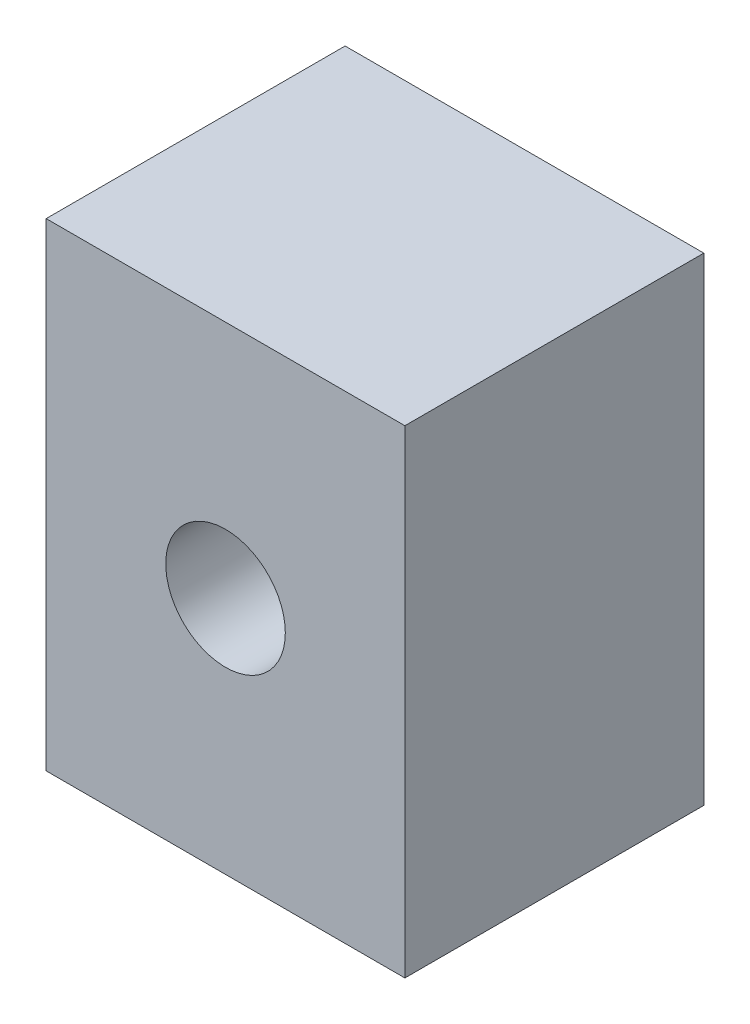
ISO-10303-21;
HEADER;
FILE_DESCRIPTION(('STEP AP214'),'2;1');
FILE_NAME('part.step','',(''),(''),'','','');
FILE_SCHEMA(('AUTOMOTIVE_DESIGN { 1 0 10303 214 1 1 1 1 }'));
ENDSEC;
DATA;
#1=APPLICATION_CONTEXT('core data for automotive mechanical design processes');
#2=APPLICATION_PROTOCOL_DEFINITION('international standard','automotive_design',2000,#1);
#3=PRODUCT_CONTEXT('',#1,'mechanical');
#4=PRODUCT('Part','Part','',(#3));
#5=PRODUCT_RELATED_PRODUCT_CATEGORY('part','',(#4));
#6=PRODUCT_DEFINITION_FORMATION('','',#4);
#7=PRODUCT_DEFINITION_CONTEXT('part definition',#1,'design');
#8=PRODUCT_DEFINITION('design','',#6,#7);
#9=PRODUCT_DEFINITION_SHAPE('','',#8);
#10=(LENGTH_UNIT() NAMED_UNIT(*) SI_UNIT(.MILLI.,.METRE.));
#11=(NAMED_UNIT(*) PLANE_ANGLE_UNIT() SI_UNIT($,.RADIAN.));
#12=(NAMED_UNIT(*) SI_UNIT($,.STERADIAN.) SOLID_ANGLE_UNIT());
#13=UNCERTAINTY_MEASURE_WITH_UNIT(LENGTH_MEASURE(1.E-05),#10,'distance_accuracy_value','');
#14=(GEOMETRIC_REPRESENTATION_CONTEXT(3) GLOBAL_UNCERTAINTY_ASSIGNED_CONTEXT((#13)) GLOBAL_UNIT_ASSIGNED_CONTEXT((#10,
#11,#12)) REPRESENTATION_CONTEXT('',''));
#15=CARTESIAN_POINT('',(0.,0.,0.));
#16=DIRECTION('',(0.,0.,1.));
#17=DIRECTION('',(1.,0.,0.));
#18=AXIS2_PLACEMENT_3D('',#15,#16,#17);
#19=CARTESIAN_POINT('',(15.,40.,12.5));
#20=DIRECTION('',(-1.,0.,0.));
#21=DIRECTION('',(0.,0.,1.));
#22=AXIS2_PLACEMENT_3D('',#19,#20,#21);
#23=PLANE('',#22);
#24=DIRECTION('',(0.,0.,-1.));
#25=VECTOR('',#24,1.);
#26=CARTESIAN_POINT('',(15.,0.,12.5));
#27=LINE('',#26,#25);
#28=CARTESIAN_POINT('',(15.,0.,12.5));
#29=VERTEX_POINT('',#28);
#30=CARTESIAN_POINT('',(15.,0.,-12.5));
#31=VERTEX_POINT('',#30);
#32=EDGE_CURVE('E107',#29,#31,#27,.T.);
#33=ORIENTED_EDGE('',*,*,#32,.T.);
#34=DIRECTION('',(0.,-1.,0.));
#35=VECTOR('',#34,1.);
#36=CARTESIAN_POINT('',(15.,40.,-12.5));
#37=LINE('',#36,#35);
#38=CARTESIAN_POINT('',(15.,40.,-12.5));
#39=VERTEX_POINT('',#38);
#40=EDGE_CURVE('E11',#39,#31,#37,.T.);
#41=ORIENTED_EDGE('',*,*,#40,.F.);
#42=DIRECTION('',(0.,0.,-1.));
#43=VECTOR('',#42,1.);
#44=CARTESIAN_POINT('',(15.,40.,12.5));
#45=LINE('',#44,#43);
#46=CARTESIAN_POINT('',(15.,40.,12.5));
#47=VERTEX_POINT('',#46);
#48=EDGE_CURVE('E91',#47,#39,#45,.T.);
#49=ORIENTED_EDGE('',*,*,#48,.F.);
#50=DIRECTION('',(0.,-1.,0.));
#51=VECTOR('',#50,1.);
#52=CARTESIAN_POINT('',(15.,40.,12.5));
#53=LINE('',#52,#51);
#54=EDGE_CURVE('E103',#47,#29,#53,.T.);
#55=ORIENTED_EDGE('',*,*,#54,.T.);
#56=EDGE_LOOP('',(#33,#41,#49,#55));
#57=FACE_BOUND('',#56,.T.);
#58=ADVANCED_FACE('F39',(#57),#23,.F.);
#59=CARTESIAN_POINT('',(-15.,40.,-12.5));
#60=DIRECTION('',(0.,0.,1.));
#61=DIRECTION('',(1.,0.,0.));
#62=AXIS2_PLACEMENT_3D('',#59,#60,#61);
#63=PLANE('',#62);
#64=CARTESIAN_POINT('',(0.,20.,-12.5));
#65=DIRECTION('',(0.,0.,1.));
#66=DIRECTION('',(1.,0.,0.));
#67=AXIS2_PLACEMENT_3D('',#64,#65,#66);
#68=CIRCLE('',#67,5.);
#69=CARTESIAN_POINT('',(5.00000000000001,20.,-12.5));
#70=VERTEX_POINT('',#69);
#71=EDGE_CURVE('E111',#70,#70,#68,.T.);
#72=ORIENTED_EDGE('',*,*,#71,.T.);
#73=EDGE_LOOP('',(#72));
#74=FACE_BOUND('',#73,.T.);
#75=DIRECTION('',(-1.,0.,0.));
#76=VECTOR('',#75,1.);
#77=CARTESIAN_POINT('',(-15.,0.,-12.5));
#78=LINE('',#77,#76);
#79=CARTESIAN_POINT('',(-15.,0.,-12.5));
#80=VERTEX_POINT('',#79);
#81=EDGE_CURVE('E96',#31,#80,#78,.T.);
#82=ORIENTED_EDGE('',*,*,#81,.T.);
#83=DIRECTION('',(0.,-1.,0.));
#84=VECTOR('',#83,1.);
#85=CARTESIAN_POINT('',(-15.,40.,-12.5));
#86=LINE('',#85,#84);
#87=CARTESIAN_POINT('',(-15.,40.,-12.5));
#88=VERTEX_POINT('',#87);
#89=EDGE_CURVE('E48',#88,#80,#86,.T.);
#90=ORIENTED_EDGE('',*,*,#89,.F.);
#91=DIRECTION('',(-1.,0.,0.));
#92=VECTOR('',#91,1.);
#93=CARTESIAN_POINT('',(-15.,40.,-12.5));
#94=LINE('',#93,#92);
#95=EDGE_CURVE('E86',#39,#88,#94,.T.);
#96=ORIENTED_EDGE('',*,*,#95,.F.);
#97=ORIENTED_EDGE('',*,*,#40,.T.);
#98=EDGE_LOOP('',(#82,#90,#96,#97));
#99=FACE_BOUND('',#98,.T.);
#100=ADVANCED_FACE('F95',(#74,#99),#63,.F.);
#101=CARTESIAN_POINT('',(-15.,40.,12.5));
#102=DIRECTION('',(1.,0.,0.));
#103=DIRECTION('',(0.,0.,-1.));
#104=AXIS2_PLACEMENT_3D('',#101,#102,#103);
#105=PLANE('',#104);
#106=DIRECTION('',(0.,0.,1.));
#107=VECTOR('',#106,1.);
#108=CARTESIAN_POINT('',(-15.,0.,12.5));
#109=LINE('',#108,#107);
#110=CARTESIAN_POINT('',(-15.,0.,12.5));
#111=VERTEX_POINT('',#110);
#112=EDGE_CURVE('E73',#80,#111,#109,.T.);
#113=ORIENTED_EDGE('',*,*,#112,.T.);
#114=DIRECTION('',(0.,-1.,0.));
#115=VECTOR('',#114,1.);
#116=CARTESIAN_POINT('',(-15.,40.,12.5));
#117=LINE('',#116,#115);
#118=CARTESIAN_POINT('',(-15.,40.,12.5));
#119=VERTEX_POINT('',#118);
#120=EDGE_CURVE('E98',#119,#111,#117,.T.);
#121=ORIENTED_EDGE('',*,*,#120,.F.);
#122=DIRECTION('',(0.,0.,1.));
#123=VECTOR('',#122,1.);
#124=CARTESIAN_POINT('',(-15.,40.,12.5));
#125=LINE('',#124,#123);
#126=EDGE_CURVE('E89',#88,#119,#125,.T.);
#127=ORIENTED_EDGE('',*,*,#126,.F.);
#128=ORIENTED_EDGE('',*,*,#89,.T.);
#129=EDGE_LOOP('',(#113,#121,#127,#128));
#130=FACE_BOUND('',#129,.T.);
#131=ADVANCED_FACE('F99',(#130),#105,.F.);
#132=CARTESIAN_POINT('',(-15.,40.,12.5));
#133=DIRECTION('',(0.,0.,-1.));
#134=DIRECTION('',(-1.,0.,0.));
#135=AXIS2_PLACEMENT_3D('',#132,#133,#134);
#136=PLANE('',#135);
#137=CARTESIAN_POINT('',(0.,20.,12.5));
#138=DIRECTION('',(0.,0.,1.));
#139=DIRECTION('',(1.,0.,0.));
#140=AXIS2_PLACEMENT_3D('',#137,#138,#139);
#141=CIRCLE('',#140,5.);
#142=CARTESIAN_POINT('',(5.00000000000001,20.,12.5));
#143=VERTEX_POINT('',#142);
#144=EDGE_CURVE('E131',#143,#143,#141,.T.);
#145=ORIENTED_EDGE('',*,*,#144,.F.);
#146=EDGE_LOOP('',(#145));
#147=FACE_BOUND('',#146,.T.);
#148=DIRECTION('',(1.,0.,0.));
#149=VECTOR('',#148,1.);
#150=CARTESIAN_POINT('',(-15.,0.,12.5));
#151=LINE('',#150,#149);
#152=EDGE_CURVE('E79',#111,#29,#151,.T.);
#153=ORIENTED_EDGE('',*,*,#152,.T.);
#154=ORIENTED_EDGE('',*,*,#54,.F.);
#155=DIRECTION('',(1.,0.,0.));
#156=VECTOR('',#155,1.);
#157=CARTESIAN_POINT('',(-15.,40.,12.5));
#158=LINE('',#157,#156);
#159=EDGE_CURVE('E56',#119,#47,#158,.T.);
#160=ORIENTED_EDGE('',*,*,#159,.F.);
#161=ORIENTED_EDGE('',*,*,#120,.T.);
#162=EDGE_LOOP('',(#153,#154,#160,#161));
#163=FACE_BOUND('',#162,.T.);
#164=ADVANCED_FACE('F121',(#147,#163),#136,.F.);
#165=CARTESIAN_POINT('',(0.,40.,0.));
#166=DIRECTION('',(0.,-1.,0.));
#167=DIRECTION('',(0.,0.,-1.));
#168=AXIS2_PLACEMENT_3D('',#165,#166,#167);
#169=PLANE('',#168);
#170=ORIENTED_EDGE('',*,*,#48,.T.);
#171=ORIENTED_EDGE('',*,*,#95,.T.);
#172=ORIENTED_EDGE('',*,*,#126,.T.);
#173=ORIENTED_EDGE('',*,*,#159,.T.);
#174=EDGE_LOOP('',(#170,#171,#172,#173));
#175=FACE_BOUND('',#174,.T.);
#176=ADVANCED_FACE('F87',(#175),#169,.F.);
#177=CARTESIAN_POINT('',(0.,0.,0.));
#178=DIRECTION('',(0.,-1.,0.));
#179=DIRECTION('',(0.,0.,-1.));
#180=AXIS2_PLACEMENT_3D('',#177,#178,#179);
#181=PLANE('',#180);
#182=ORIENTED_EDGE('',*,*,#32,.F.);
#183=ORIENTED_EDGE('',*,*,#152,.F.);
#184=ORIENTED_EDGE('',*,*,#112,.F.);
#185=ORIENTED_EDGE('',*,*,#81,.F.);
#186=EDGE_LOOP('',(#182,#183,#184,#185));
#187=FACE_BOUND('',#186,.T.);
#188=ADVANCED_FACE('F124',(#187),#181,.T.);
#189=CARTESIAN_POINT('',(0.,20.,-27.5));
#190=DIRECTION('',(0.,0.,1.));
#191=DIRECTION('',(1.,0.,0.));
#192=AXIS2_PLACEMENT_3D('',#189,#190,#191);
#193=CYLINDRICAL_SURFACE('',#192,5.);
#194=ORIENTED_EDGE('',*,*,#144,.T.);
#195=EDGE_LOOP('',(#194));
#196=FACE_BOUND('',#195,.T.);
#197=ORIENTED_EDGE('',*,*,#71,.F.);
#198=EDGE_LOOP('',(#197));
#199=FACE_BOUND('',#198,.T.);
#200=ADVANCED_FACE('F136',(#196,#199),#193,.F.);
#201=CLOSED_SHELL('',(#58,#100,#131,#164,#176,#188,#200));
#202=MANIFOLD_SOLID_BREP('B2',#201);
#203=ADVANCED_BREP_SHAPE_REPRESENTATION('',(#18,#202),#14);
#204=SHAPE_DEFINITION_REPRESENTATION(#9,#203);
ENDSEC;
END-ISO-10303-21;
